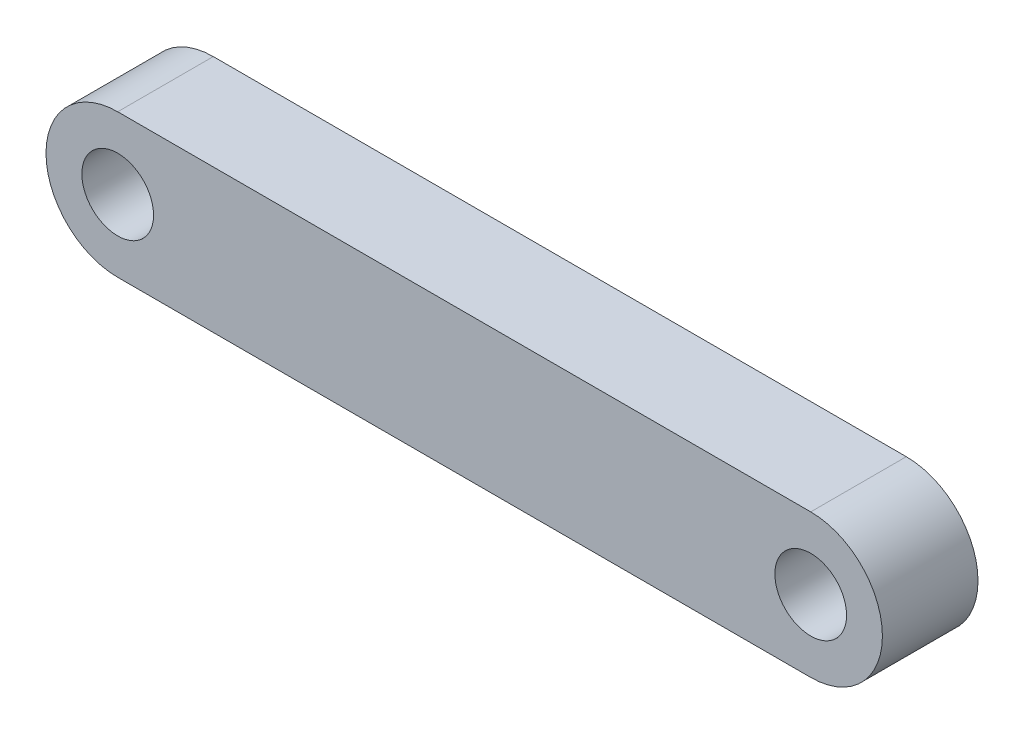
ISO-10303-21;
HEADER;
FILE_DESCRIPTION(('STEP AP214'),'2;1');
FILE_NAME('part.step','',(''),(''),'','','');
FILE_SCHEMA(('AUTOMOTIVE_DESIGN { 1 0 10303 214 1 1 1 1 }'));
ENDSEC;
DATA;
#1=APPLICATION_CONTEXT('core data for automotive mechanical design processes');
#2=APPLICATION_PROTOCOL_DEFINITION('international standard','automotive_design',2000,#1);
#3=PRODUCT_CONTEXT('',#1,'mechanical');
#4=PRODUCT('Part','Part','',(#3));
#5=PRODUCT_RELATED_PRODUCT_CATEGORY('part','',(#4));
#6=PRODUCT_DEFINITION_FORMATION('','',#4);
#7=PRODUCT_DEFINITION_CONTEXT('part definition',#1,'design');
#8=PRODUCT_DEFINITION('design','',#6,#7);
#9=PRODUCT_DEFINITION_SHAPE('','',#8);
#10=(LENGTH_UNIT() NAMED_UNIT(*) SI_UNIT(.MILLI.,.METRE.));
#11=(NAMED_UNIT(*) PLANE_ANGLE_UNIT() SI_UNIT($,.RADIAN.));
#12=(NAMED_UNIT(*) SI_UNIT($,.STERADIAN.) SOLID_ANGLE_UNIT());
#13=UNCERTAINTY_MEASURE_WITH_UNIT(LENGTH_MEASURE(1.E-05),#10,'distance_accuracy_value','');
#14=(GEOMETRIC_REPRESENTATION_CONTEXT(3) GLOBAL_UNCERTAINTY_ASSIGNED_CONTEXT((#13)) GLOBAL_UNIT_ASSIGNED_CONTEXT((#10,
#11,#12)) REPRESENTATION_CONTEXT('',''));
#15=CARTESIAN_POINT('',(0.,0.,0.));
#16=DIRECTION('',(0.,0.,1.));
#17=DIRECTION('',(1.,0.,0.));
#18=AXIS2_PLACEMENT_3D('',#15,#16,#17);
#19=CARTESIAN_POINT('',(2.99999930474809,2.99999975544267,4.));
#20=DIRECTION('',(0.,0.,1.));
#21=DIRECTION('',(1.,0.,0.));
#22=AXIS2_PLACEMENT_3D('',#19,#20,#21);
#23=PLANE('',#22);
#24=CARTESIAN_POINT('',(2.99999930474809,2.99999975544267,4.));
#25=DIRECTION('',(0.,0.,1.));
#26=DIRECTION('',(1.,0.,0.));
#27=AXIS2_PLACEMENT_3D('',#24,#25,#26);
#28=CIRCLE('',#27,1.5);
#29=CARTESIAN_POINT('',(4.49999930474809,2.99999975544267,4.));
#30=VERTEX_POINT('',#29);
#31=EDGE_CURVE('E99',#30,#30,#28,.T.);
#32=ORIENTED_EDGE('',*,*,#31,.F.);
#33=EDGE_LOOP('',(#32));
#34=FACE_BOUND('',#33,.T.);
#35=CARTESIAN_POINT('',(2.99999930474809,2.99999975544267,4.));
#36=DIRECTION('',(0.,0.,1.));
#37=DIRECTION('',(1.,0.,0.));
#38=AXIS2_PLACEMENT_3D('',#35,#36,#37);
#39=CIRCLE('',#38,3.);
#40=CARTESIAN_POINT('',(2.99999930474809,5.99999975544266,4.));
#41=VERTEX_POINT('',#40);
#42=CARTESIAN_POINT('',(2.99999930474809,-2.445573415E-07,4.));
#43=VERTEX_POINT('',#42);
#44=EDGE_CURVE('E84',#41,#43,#39,.T.);
#45=ORIENTED_EDGE('',*,*,#44,.T.);
#46=DIRECTION('',(1.,0.,0.));
#47=VECTOR('',#46,1.);
#48=CARTESIAN_POINT('',(31.9999993047481,-2.445573415E-07,4.));
#49=LINE('',#48,#47);
#50=CARTESIAN_POINT('',(31.9999993047481,-2.4455732794762E-07,4.));
#51=VERTEX_POINT('',#50);
#52=EDGE_CURVE('E79',#43,#51,#49,.T.);
#53=ORIENTED_EDGE('',*,*,#52,.T.);
#54=CARTESIAN_POINT('',(31.9999993047481,2.99999975544267,4.));
#55=DIRECTION('',(0.,0.,1.));
#56=DIRECTION('',(1.,0.,0.));
#57=AXIS2_PLACEMENT_3D('',#54,#55,#56);
#58=CIRCLE('',#57,3.);
#59=CARTESIAN_POINT('',(31.9999993047481,5.99999975544266,4.));
#60=VERTEX_POINT('',#59);
#61=EDGE_CURVE('E82',#51,#60,#58,.T.);
#62=ORIENTED_EDGE('',*,*,#61,.T.);
#63=DIRECTION('',(-1.,0.,0.));
#64=VECTOR('',#63,1.);
#65=CARTESIAN_POINT('',(2.99999930474809,5.99999975544266,4.));
#66=LINE('',#65,#64);
#67=EDGE_CURVE('E49',#60,#41,#66,.T.);
#68=ORIENTED_EDGE('',*,*,#67,.T.);
#69=EDGE_LOOP('',(#45,#53,#62,#68));
#70=FACE_BOUND('',#69,.T.);
#71=CARTESIAN_POINT('',(31.9999993047481,2.99999975544267,4.));
#72=DIRECTION('',(0.,0.,1.));
#73=DIRECTION('',(1.,0.,0.));
#74=AXIS2_PLACEMENT_3D('',#71,#72,#73);
#75=CIRCLE('',#74,1.5);
#76=CARTESIAN_POINT('',(33.4999993047481,2.99999975544267,4.));
#77=VERTEX_POINT('',#76);
#78=EDGE_CURVE('E114',#77,#77,#75,.T.);
#79=ORIENTED_EDGE('',*,*,#78,.F.);
#80=EDGE_LOOP('',(#79));
#81=FACE_BOUND('',#80,.T.);
#82=ADVANCED_FACE('F32',(#34,#70,#81),#23,.T.);
#83=CARTESIAN_POINT('',(2.99999930474809,2.99999975544267,0.));
#84=DIRECTION('',(0.,0.,1.));
#85=DIRECTION('',(1.,0.,0.));
#86=AXIS2_PLACEMENT_3D('',#83,#84,#85);
#87=PLANE('',#86);
#88=CARTESIAN_POINT('',(2.99999930474809,2.99999975544267,0.));
#89=DIRECTION('',(0.,0.,1.));
#90=DIRECTION('',(1.,0.,0.));
#91=AXIS2_PLACEMENT_3D('',#88,#89,#90);
#92=CIRCLE('',#91,1.5);
#93=CARTESIAN_POINT('',(4.49999930474809,2.99999975544267,0.));
#94=VERTEX_POINT('',#93);
#95=EDGE_CURVE('E111',#94,#94,#92,.T.);
#96=ORIENTED_EDGE('',*,*,#95,.T.);
#97=EDGE_LOOP('',(#96));
#98=FACE_BOUND('',#97,.T.);
#99=CARTESIAN_POINT('',(2.99999930474809,2.99999975544267,0.));
#100=DIRECTION('',(0.,0.,1.));
#101=DIRECTION('',(1.,0.,0.));
#102=AXIS2_PLACEMENT_3D('',#99,#100,#101);
#103=CIRCLE('',#102,3.);
#104=CARTESIAN_POINT('',(2.99999930474809,5.99999975544266,0.));
#105=VERTEX_POINT('',#104);
#106=CARTESIAN_POINT('',(2.99999930474809,-2.445573415E-07,0.));
#107=VERTEX_POINT('',#106);
#108=EDGE_CURVE('E96',#105,#107,#103,.T.);
#109=ORIENTED_EDGE('',*,*,#108,.F.);
#110=DIRECTION('',(-1.,0.,0.));
#111=VECTOR('',#110,1.);
#112=CARTESIAN_POINT('',(2.99999930474809,5.99999975544266,0.));
#113=LINE('',#112,#111);
#114=CARTESIAN_POINT('',(31.9999993047481,5.99999975544266,0.));
#115=VERTEX_POINT('',#114);
#116=EDGE_CURVE('E72',#115,#105,#113,.T.);
#117=ORIENTED_EDGE('',*,*,#116,.F.);
#118=CARTESIAN_POINT('',(31.9999993047481,2.99999975544267,0.));
#119=DIRECTION('',(0.,0.,1.));
#120=DIRECTION('',(1.,0.,0.));
#121=AXIS2_PLACEMENT_3D('',#118,#119,#120);
#122=CIRCLE('',#121,3.);
#123=CARTESIAN_POINT('',(31.9999993047481,-2.4455732794762E-07,0.));
#124=VERTEX_POINT('',#123);
#125=EDGE_CURVE('E66',#124,#115,#122,.T.);
#126=ORIENTED_EDGE('',*,*,#125,.F.);
#127=DIRECTION('',(1.,0.,0.));
#128=VECTOR('',#127,1.);
#129=CARTESIAN_POINT('',(31.9999993047481,-2.445573415E-07,0.));
#130=LINE('',#129,#128);
#131=EDGE_CURVE('E88',#107,#124,#130,.T.);
#132=ORIENTED_EDGE('',*,*,#131,.F.);
#133=EDGE_LOOP('',(#109,#117,#126,#132));
#134=FACE_BOUND('',#133,.T.);
#135=CARTESIAN_POINT('',(31.9999993047481,2.99999975544267,0.));
#136=DIRECTION('',(0.,0.,1.));
#137=DIRECTION('',(1.,0.,0.));
#138=AXIS2_PLACEMENT_3D('',#135,#136,#137);
#139=CIRCLE('',#138,1.5);
#140=CARTESIAN_POINT('',(33.4999993047481,2.99999975544267,0.));
#141=VERTEX_POINT('',#140);
#142=EDGE_CURVE('E117',#141,#141,#139,.T.);
#143=ORIENTED_EDGE('',*,*,#142,.T.);
#144=EDGE_LOOP('',(#143));
#145=FACE_BOUND('',#144,.T.);
#146=ADVANCED_FACE('F107',(#98,#134,#145),#87,.F.);
#147=CARTESIAN_POINT('',(2.99999930474809,2.99999975544267,4.));
#148=DIRECTION('',(0.,0.,-1.));
#149=DIRECTION('',(-1.,0.,0.));
#150=AXIS2_PLACEMENT_3D('',#147,#148,#149);
#151=CYLINDRICAL_SURFACE('',#150,3.);
#152=ORIENTED_EDGE('',*,*,#108,.T.);
#153=DIRECTION('',(0.,0.,-1.));
#154=VECTOR('',#153,1.);
#155=CARTESIAN_POINT('',(2.99999930474809,-2.445573415E-07,4.));
#156=LINE('',#155,#154);
#157=EDGE_CURVE('E11',#43,#107,#156,.T.);
#158=ORIENTED_EDGE('',*,*,#157,.F.);
#159=ORIENTED_EDGE('',*,*,#44,.F.);
#160=DIRECTION('',(0.,0.,-1.));
#161=VECTOR('',#160,1.);
#162=CARTESIAN_POINT('',(2.99999930474809,5.99999975544266,4.));
#163=LINE('',#162,#161);
#164=EDGE_CURVE('E92',#41,#105,#163,.T.);
#165=ORIENTED_EDGE('',*,*,#164,.T.);
#166=EDGE_LOOP('',(#152,#158,#159,#165));
#167=FACE_BOUND('',#166,.T.);
#168=ADVANCED_FACE('F34',(#167),#151,.T.);
#169=CARTESIAN_POINT('',(31.9999993047481,-2.445573415E-07,4.));
#170=DIRECTION('',(0.,1.,0.));
#171=DIRECTION('',(0.,0.,1.));
#172=AXIS2_PLACEMENT_3D('',#169,#170,#171);
#173=PLANE('',#172);
#174=ORIENTED_EDGE('',*,*,#131,.T.);
#175=DIRECTION('',(0.,0.,-1.));
#176=VECTOR('',#175,1.);
#177=CARTESIAN_POINT('',(31.9999993047481,-2.4455732794762E-07,4.));
#178=LINE('',#177,#176);
#179=EDGE_CURVE('E41',#51,#124,#178,.T.);
#180=ORIENTED_EDGE('',*,*,#179,.F.);
#181=ORIENTED_EDGE('',*,*,#52,.F.);
#182=ORIENTED_EDGE('',*,*,#157,.T.);
#183=EDGE_LOOP('',(#174,#180,#181,#182));
#184=FACE_BOUND('',#183,.T.);
#185=ADVANCED_FACE('F87',(#184),#173,.F.);
#186=CARTESIAN_POINT('',(31.9999993047481,2.99999975544267,4.));
#187=DIRECTION('',(0.,0.,-1.));
#188=DIRECTION('',(-1.,0.,0.));
#189=AXIS2_PLACEMENT_3D('',#186,#187,#188);
#190=CYLINDRICAL_SURFACE('',#189,3.);
#191=ORIENTED_EDGE('',*,*,#125,.T.);
#192=DIRECTION('',(0.,0.,-1.));
#193=VECTOR('',#192,1.);
#194=CARTESIAN_POINT('',(31.9999993047481,5.99999975544266,4.));
#195=LINE('',#194,#193);
#196=EDGE_CURVE('E89',#60,#115,#195,.T.);
#197=ORIENTED_EDGE('',*,*,#196,.F.);
#198=ORIENTED_EDGE('',*,*,#61,.F.);
#199=ORIENTED_EDGE('',*,*,#179,.T.);
#200=EDGE_LOOP('',(#191,#197,#198,#199));
#201=FACE_BOUND('',#200,.T.);
#202=ADVANCED_FACE('F90',(#201),#190,.T.);
#203=CARTESIAN_POINT('',(2.99999930474809,5.99999975544266,4.));
#204=DIRECTION('',(0.,-1.,0.));
#205=DIRECTION('',(0.,0.,-1.));
#206=AXIS2_PLACEMENT_3D('',#203,#204,#205);
#207=PLANE('',#206);
#208=ORIENTED_EDGE('',*,*,#116,.T.);
#209=ORIENTED_EDGE('',*,*,#164,.F.);
#210=ORIENTED_EDGE('',*,*,#67,.F.);
#211=ORIENTED_EDGE('',*,*,#196,.T.);
#212=EDGE_LOOP('',(#208,#209,#210,#211));
#213=FACE_BOUND('',#212,.T.);
#214=ADVANCED_FACE('F104',(#213),#207,.F.);
#215=CARTESIAN_POINT('',(2.99999930474809,2.99999975544267,4.));
#216=DIRECTION('',(0.,0.,-1.));
#217=DIRECTION('',(-1.,0.,0.));
#218=AXIS2_PLACEMENT_3D('',#215,#216,#217);
#219=CYLINDRICAL_SURFACE('',#218,1.5);
#220=ORIENTED_EDGE('',*,*,#31,.T.);
#221=EDGE_LOOP('',(#220));
#222=FACE_BOUND('',#221,.T.);
#223=ORIENTED_EDGE('',*,*,#95,.F.);
#224=EDGE_LOOP('',(#223));
#225=FACE_BOUND('',#224,.T.);
#226=ADVANCED_FACE('F135',(#222,#225),#219,.F.);
#227=CARTESIAN_POINT('',(31.9999993047481,2.99999975544267,4.));
#228=DIRECTION('',(0.,0.,-1.));
#229=DIRECTION('',(-1.,0.,0.));
#230=AXIS2_PLACEMENT_3D('',#227,#228,#229);
#231=CYLINDRICAL_SURFACE('',#230,1.5);
#232=ORIENTED_EDGE('',*,*,#78,.T.);
#233=EDGE_LOOP('',(#232));
#234=FACE_BOUND('',#233,.T.);
#235=ORIENTED_EDGE('',*,*,#142,.F.);
#236=EDGE_LOOP('',(#235));
#237=FACE_BOUND('',#236,.T.);
#238=ADVANCED_FACE('F123',(#234,#237),#231,.F.);
#239=CLOSED_SHELL('',(#82,#146,#168,#185,#202,#214,#226,#238));
#240=MANIFOLD_SOLID_BREP('B2',#239);
#241=ADVANCED_BREP_SHAPE_REPRESENTATION('',(#18,#240),#14);
#242=SHAPE_DEFINITION_REPRESENTATION(#9,#241);
ENDSEC;
END-ISO-10303-21;
